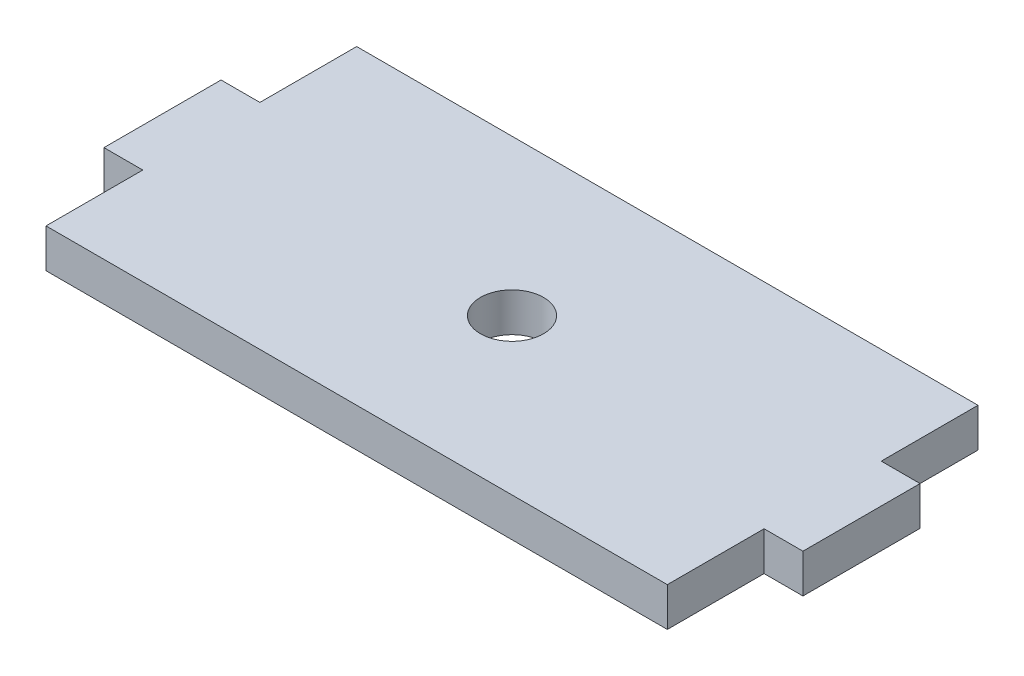
ISO-10303-21;
HEADER;
FILE_DESCRIPTION(('STEP AP214'),'2;1');
FILE_NAME('part.step','',(''),(''),'','','');
FILE_SCHEMA(('AUTOMOTIVE_DESIGN { 1 0 10303 214 1 1 1 1 }'));
ENDSEC;
DATA;
#1=APPLICATION_CONTEXT('core data for automotive mechanical design processes');
#2=APPLICATION_PROTOCOL_DEFINITION('international standard','automotive_design',2000,#1);
#3=PRODUCT_CONTEXT('',#1,'mechanical');
#4=PRODUCT('Part','Part','',(#3));
#5=PRODUCT_RELATED_PRODUCT_CATEGORY('part','',(#4));
#6=PRODUCT_DEFINITION_FORMATION('','',#4);
#7=PRODUCT_DEFINITION_CONTEXT('part definition',#1,'design');
#8=PRODUCT_DEFINITION('design','',#6,#7);
#9=PRODUCT_DEFINITION_SHAPE('','',#8);
#10=(LENGTH_UNIT() NAMED_UNIT(*) SI_UNIT(.MILLI.,.METRE.));
#11=(NAMED_UNIT(*) PLANE_ANGLE_UNIT() SI_UNIT($,.RADIAN.));
#12=(NAMED_UNIT(*) SI_UNIT($,.STERADIAN.) SOLID_ANGLE_UNIT());
#13=UNCERTAINTY_MEASURE_WITH_UNIT(LENGTH_MEASURE(1.E-05),#10,'distance_accuracy_value','');
#14=(GEOMETRIC_REPRESENTATION_CONTEXT(3) GLOBAL_UNCERTAINTY_ASSIGNED_CONTEXT((#13)) GLOBAL_UNIT_ASSIGNED_CONTEXT((#10,
#11,#12)) REPRESENTATION_CONTEXT('',''));
#15=CARTESIAN_POINT('',(0.,0.,0.));
#16=DIRECTION('',(0.,0.,1.));
#17=DIRECTION('',(1.,0.,0.));
#18=AXIS2_PLACEMENT_3D('',#15,#16,#17);
#19=CARTESIAN_POINT('',(25.4,1.5875,0.));
#20=DIRECTION('',(1.,0.,0.));
#21=DIRECTION('',(0.,0.,-1.));
#22=AXIS2_PLACEMENT_3D('',#19,#20,#21);
#23=PLANE('',#22);
#24=DIRECTION('',(0.,0.,1.));
#25=VECTOR('',#24,1.);
#26=CARTESIAN_POINT('',(25.4,-1.5875,0.));
#27=LINE('',#26,#25);
#28=CARTESIAN_POINT('',(25.4,-1.5875,4.7879));
#29=VERTEX_POINT('',#28);
#30=CARTESIAN_POINT('',(25.4,-1.5875,12.7));
#31=VERTEX_POINT('',#30);
#32=EDGE_CURVE('E201',#29,#31,#27,.T.);
#33=ORIENTED_EDGE('',*,*,#32,.F.);
#34=DIRECTION('',(0.,-1.,0.));
#35=VECTOR('',#34,1.);
#36=CARTESIAN_POINT('',(25.4,1.5875,4.7879));
#37=LINE('',#36,#35);
#38=CARTESIAN_POINT('',(25.4,1.5875,4.7879));
#39=VERTEX_POINT('',#38);
#40=EDGE_CURVE('E11',#39,#29,#37,.T.);
#41=ORIENTED_EDGE('',*,*,#40,.F.);
#42=DIRECTION('',(0.,0.,1.));
#43=VECTOR('',#42,1.);
#44=CARTESIAN_POINT('',(25.4,1.5875,0.));
#45=LINE('',#44,#43);
#46=CARTESIAN_POINT('',(25.4,1.5875,12.7));
#47=VERTEX_POINT('',#46);
#48=EDGE_CURVE('E298',#39,#47,#45,.T.);
#49=ORIENTED_EDGE('',*,*,#48,.T.);
#50=DIRECTION('',(0.,-1.,0.));
#51=VECTOR('',#50,1.);
#52=CARTESIAN_POINT('',(25.4,1.5875,12.7));
#53=LINE('',#52,#51);
#54=EDGE_CURVE('E103',#47,#31,#53,.T.);
#55=ORIENTED_EDGE('',*,*,#54,.T.);
#56=EDGE_LOOP('',(#33,#41,#49,#55));
#57=FACE_BOUND('',#56,.T.);
#58=ADVANCED_FACE('F39',(#57),#23,.T.);
#59=CARTESIAN_POINT('',(0.,1.5875,4.7879));
#60=DIRECTION('',(0.,0.,-1.));
#61=DIRECTION('',(-1.,0.,0.));
#62=AXIS2_PLACEMENT_3D('',#59,#60,#61);
#63=PLANE('',#62);
#64=DIRECTION('',(1.,0.,0.));
#65=VECTOR('',#64,1.);
#66=CARTESIAN_POINT('',(0.,-1.5875,4.7879));
#67=LINE('',#66,#65);
#68=CARTESIAN_POINT('',(28.575,-1.5875,4.7879));
#69=VERTEX_POINT('',#68);
#70=EDGE_CURVE('E198',#29,#69,#67,.T.);
#71=ORIENTED_EDGE('',*,*,#70,.T.);
#72=DIRECTION('',(0.,-1.,0.));
#73=VECTOR('',#72,1.);
#74=CARTESIAN_POINT('',(28.575,1.5875,4.7879));
#75=LINE('',#74,#73);
#76=CARTESIAN_POINT('',(28.575,1.5875,4.7879));
#77=VERTEX_POINT('',#76);
#78=EDGE_CURVE('E49',#77,#69,#75,.T.);
#79=ORIENTED_EDGE('',*,*,#78,.F.);
#80=DIRECTION('',(1.,0.,0.));
#81=VECTOR('',#80,1.);
#82=CARTESIAN_POINT('',(0.,1.5875,4.7879));
#83=LINE('',#82,#81);
#84=EDGE_CURVE('E301',#39,#77,#83,.T.);
#85=ORIENTED_EDGE('',*,*,#84,.F.);
#86=ORIENTED_EDGE('',*,*,#40,.T.);
#87=EDGE_LOOP('',(#71,#79,#85,#86));
#88=FACE_BOUND('',#87,.T.);
#89=ADVANCED_FACE('F199',(#88),#63,.F.);
#90=CARTESIAN_POINT('',(28.575,1.5875,0.));
#91=DIRECTION('',(1.,0.,0.));
#92=DIRECTION('',(0.,0.,-1.));
#93=AXIS2_PLACEMENT_3D('',#90,#91,#92);
#94=PLANE('',#93);
#95=DIRECTION('',(0.,0.,1.));
#96=VECTOR('',#95,1.);
#97=CARTESIAN_POINT('',(28.575,-1.5875,0.));
#98=LINE('',#97,#96);
#99=CARTESIAN_POINT('',(28.575,-1.5875,-4.7879));
#100=VERTEX_POINT('',#99);
#101=EDGE_CURVE('E192',#100,#69,#98,.T.);
#102=ORIENTED_EDGE('',*,*,#101,.F.);
#103=DIRECTION('',(0.,-1.,0.));
#104=VECTOR('',#103,1.);
#105=CARTESIAN_POINT('',(28.575,1.5875,-4.7879));
#106=LINE('',#105,#104);
#107=CARTESIAN_POINT('',(28.575,1.5875,-4.7879));
#108=VERTEX_POINT('',#107);
#109=EDGE_CURVE('E182',#108,#100,#106,.T.);
#110=ORIENTED_EDGE('',*,*,#109,.F.);
#111=DIRECTION('',(0.,0.,1.));
#112=VECTOR('',#111,1.);
#113=CARTESIAN_POINT('',(28.575,1.5875,0.));
#114=LINE('',#113,#112);
#115=EDGE_CURVE('E195',#108,#77,#114,.T.);
#116=ORIENTED_EDGE('',*,*,#115,.T.);
#117=ORIENTED_EDGE('',*,*,#78,.T.);
#118=EDGE_LOOP('',(#102,#110,#116,#117));
#119=FACE_BOUND('',#118,.T.);
#120=ADVANCED_FACE('F190',(#119),#94,.T.);
#121=CARTESIAN_POINT('',(0.,1.5875,-4.7879));
#122=DIRECTION('',(0.,0.,-1.));
#123=DIRECTION('',(-1.,0.,0.));
#124=AXIS2_PLACEMENT_3D('',#121,#122,#123);
#125=PLANE('',#124);
#126=DIRECTION('',(1.,0.,0.));
#127=VECTOR('',#126,1.);
#128=CARTESIAN_POINT('',(0.,-1.5875,-4.7879));
#129=LINE('',#128,#127);
#130=CARTESIAN_POINT('',(25.4,-1.5875,-4.7879));
#131=VERTEX_POINT('',#130);
#132=EDGE_CURVE('E206',#131,#100,#129,.T.);
#133=ORIENTED_EDGE('',*,*,#132,.F.);
#134=DIRECTION('',(0.,-1.,0.));
#135=VECTOR('',#134,1.);
#136=CARTESIAN_POINT('',(25.4,1.5875,-4.7879));
#137=LINE('',#136,#135);
#138=CARTESIAN_POINT('',(25.4,1.5875,-4.7879));
#139=VERTEX_POINT('',#138);
#140=EDGE_CURVE('E179',#139,#131,#137,.T.);
#141=ORIENTED_EDGE('',*,*,#140,.F.);
#142=DIRECTION('',(1.,0.,0.));
#143=VECTOR('',#142,1.);
#144=CARTESIAN_POINT('',(0.,1.5875,-4.7879));
#145=LINE('',#144,#143);
#146=EDGE_CURVE('E308',#139,#108,#145,.T.);
#147=ORIENTED_EDGE('',*,*,#146,.T.);
#148=ORIENTED_EDGE('',*,*,#109,.T.);
#149=EDGE_LOOP('',(#133,#141,#147,#148));
#150=FACE_BOUND('',#149,.T.);
#151=ADVANCED_FACE('F255',(#150),#125,.T.);
#152=CARTESIAN_POINT('',(25.4,1.5875,0.));
#153=DIRECTION('',(1.,0.,0.));
#154=DIRECTION('',(0.,0.,-1.));
#155=AXIS2_PLACEMENT_3D('',#152,#153,#154);
#156=PLANE('',#155);
#157=DIRECTION('',(0.,0.,1.));
#158=VECTOR('',#157,1.);
#159=CARTESIAN_POINT('',(25.4,-1.5875,0.));
#160=LINE('',#159,#158);
#161=CARTESIAN_POINT('',(25.3999999999999,-1.5875,-12.7));
#162=VERTEX_POINT('',#161);
#163=EDGE_CURVE('E210',#162,#131,#160,.T.);
#164=ORIENTED_EDGE('',*,*,#163,.F.);
#165=DIRECTION('',(0.,-1.,0.));
#166=VECTOR('',#165,1.);
#167=CARTESIAN_POINT('',(25.3999999999999,1.5875,-12.7));
#168=LINE('',#167,#166);
#169=CARTESIAN_POINT('',(25.3999999999999,1.5875,-12.7));
#170=VERTEX_POINT('',#169);
#171=EDGE_CURVE('E176',#170,#162,#168,.T.);
#172=ORIENTED_EDGE('',*,*,#171,.F.);
#173=DIRECTION('',(0.,0.,1.));
#174=VECTOR('',#173,1.);
#175=CARTESIAN_POINT('',(25.4,1.5875,0.));
#176=LINE('',#175,#174);
#177=EDGE_CURVE('E312',#170,#139,#176,.T.);
#178=ORIENTED_EDGE('',*,*,#177,.T.);
#179=ORIENTED_EDGE('',*,*,#140,.T.);
#180=EDGE_LOOP('',(#164,#172,#178,#179));
#181=FACE_BOUND('',#180,.T.);
#182=ADVANCED_FACE('F258',(#181),#156,.T.);
#183=CARTESIAN_POINT('',(0.,1.5875,-12.7));
#184=DIRECTION('',(0.,0.,-1.));
#185=DIRECTION('',(-1.,0.,0.));
#186=AXIS2_PLACEMENT_3D('',#183,#184,#185);
#187=PLANE('',#186);
#188=DIRECTION('',(1.,0.,0.));
#189=VECTOR('',#188,1.);
#190=CARTESIAN_POINT('',(0.,-1.5875,-12.7));
#191=LINE('',#190,#189);
#192=CARTESIAN_POINT('',(-25.4000000000001,-1.5875,-12.7));
#193=VERTEX_POINT('',#192);
#194=EDGE_CURVE('E216',#193,#162,#191,.T.);
#195=ORIENTED_EDGE('',*,*,#194,.F.);
#196=DIRECTION('',(0.,-1.,0.));
#197=VECTOR('',#196,1.);
#198=CARTESIAN_POINT('',(-25.4000000000001,1.5875,-12.7));
#199=LINE('',#198,#197);
#200=CARTESIAN_POINT('',(-25.4000000000001,1.5875,-12.7));
#201=VERTEX_POINT('',#200);
#202=EDGE_CURVE('E173',#201,#193,#199,.T.);
#203=ORIENTED_EDGE('',*,*,#202,.F.);
#204=DIRECTION('',(1.,0.,0.));
#205=VECTOR('',#204,1.);
#206=CARTESIAN_POINT('',(0.,1.5875,-12.7));
#207=LINE('',#206,#205);
#208=EDGE_CURVE('E316',#201,#170,#207,.T.);
#209=ORIENTED_EDGE('',*,*,#208,.T.);
#210=ORIENTED_EDGE('',*,*,#171,.T.);
#211=EDGE_LOOP('',(#195,#203,#209,#210));
#212=FACE_BOUND('',#211,.T.);
#213=ADVANCED_FACE('F262',(#212),#187,.T.);
#214=CARTESIAN_POINT('',(-25.4,1.5875,0.));
#215=DIRECTION('',(1.,0.,0.));
#216=DIRECTION('',(0.,0.,-1.));
#217=AXIS2_PLACEMENT_3D('',#214,#215,#216);
#218=PLANE('',#217);
#219=DIRECTION('',(0.,0.,1.));
#220=VECTOR('',#219,1.);
#221=CARTESIAN_POINT('',(-25.4,-1.5875,0.));
#222=LINE('',#221,#220);
#223=CARTESIAN_POINT('',(-25.4,-1.5875,-4.7879));
#224=VERTEX_POINT('',#223);
#225=EDGE_CURVE('E220',#193,#224,#222,.T.);
#226=ORIENTED_EDGE('',*,*,#225,.T.);
#227=DIRECTION('',(0.,-1.,0.));
#228=VECTOR('',#227,1.);
#229=CARTESIAN_POINT('',(-25.4,1.5875,-4.7879));
#230=LINE('',#229,#228);
#231=CARTESIAN_POINT('',(-25.4,1.5875,-4.7879));
#232=VERTEX_POINT('',#231);
#233=EDGE_CURVE('E170',#232,#224,#230,.T.);
#234=ORIENTED_EDGE('',*,*,#233,.F.);
#235=DIRECTION('',(0.,0.,1.));
#236=VECTOR('',#235,1.);
#237=CARTESIAN_POINT('',(-25.4,1.5875,0.));
#238=LINE('',#237,#236);
#239=EDGE_CURVE('E320',#201,#232,#238,.T.);
#240=ORIENTED_EDGE('',*,*,#239,.F.);
#241=ORIENTED_EDGE('',*,*,#202,.T.);
#242=EDGE_LOOP('',(#226,#234,#240,#241));
#243=FACE_BOUND('',#242,.T.);
#244=ADVANCED_FACE('F266',(#243),#218,.F.);
#245=CARTESIAN_POINT('',(0.,1.5875,-4.78790000000001));
#246=DIRECTION('',(0.,0.,-1.));
#247=DIRECTION('',(-1.,0.,0.));
#248=AXIS2_PLACEMENT_3D('',#245,#246,#247);
#249=PLANE('',#248);
#250=DIRECTION('',(1.,0.,0.));
#251=VECTOR('',#250,1.);
#252=CARTESIAN_POINT('',(0.,-1.5875,-4.78790000000001));
#253=LINE('',#252,#251);
#254=CARTESIAN_POINT('',(-28.575,-1.5875,-4.7879));
#255=VERTEX_POINT('',#254);
#256=EDGE_CURVE('E224',#255,#224,#253,.T.);
#257=ORIENTED_EDGE('',*,*,#256,.F.);
#258=DIRECTION('',(0.,-1.,0.));
#259=VECTOR('',#258,1.);
#260=CARTESIAN_POINT('',(-28.575,1.5875,-4.7879));
#261=LINE('',#260,#259);
#262=CARTESIAN_POINT('',(-28.575,1.5875,-4.7879));
#263=VERTEX_POINT('',#262);
#264=EDGE_CURVE('E163',#263,#255,#261,.T.);
#265=ORIENTED_EDGE('',*,*,#264,.F.);
#266=DIRECTION('',(1.,0.,0.));
#267=VECTOR('',#266,1.);
#268=CARTESIAN_POINT('',(0.,1.5875,-4.78790000000001));
#269=LINE('',#268,#267);
#270=EDGE_CURVE('E323',#263,#232,#269,.T.);
#271=ORIENTED_EDGE('',*,*,#270,.T.);
#272=ORIENTED_EDGE('',*,*,#233,.T.);
#273=EDGE_LOOP('',(#257,#265,#271,#272));
#274=FACE_BOUND('',#273,.T.);
#275=ADVANCED_FACE('F270',(#274),#249,.T.);
#276=CARTESIAN_POINT('',(-28.575,1.5875,0.));
#277=DIRECTION('',(1.,0.,0.));
#278=DIRECTION('',(0.,0.,-1.));
#279=AXIS2_PLACEMENT_3D('',#276,#277,#278);
#280=PLANE('',#279);
#281=DIRECTION('',(0.,0.,1.));
#282=VECTOR('',#281,1.);
#283=CARTESIAN_POINT('',(-28.575,-1.5875,0.));
#284=LINE('',#283,#282);
#285=CARTESIAN_POINT('',(-28.575,-1.5875,4.7879));
#286=VERTEX_POINT('',#285);
#287=EDGE_CURVE('E228',#255,#286,#284,.T.);
#288=ORIENTED_EDGE('',*,*,#287,.T.);
#289=DIRECTION('',(0.,-1.,0.));
#290=VECTOR('',#289,1.);
#291=CARTESIAN_POINT('',(-28.575,1.5875,4.7879));
#292=LINE('',#291,#290);
#293=CARTESIAN_POINT('',(-28.575,1.5875,4.7879));
#294=VERTEX_POINT('',#293);
#295=EDGE_CURVE('E159',#294,#286,#292,.T.);
#296=ORIENTED_EDGE('',*,*,#295,.F.);
#297=DIRECTION('',(0.,0.,1.));
#298=VECTOR('',#297,1.);
#299=CARTESIAN_POINT('',(-28.575,1.5875,0.));
#300=LINE('',#299,#298);
#301=EDGE_CURVE('E150',#263,#294,#300,.T.);
#302=ORIENTED_EDGE('',*,*,#301,.F.);
#303=ORIENTED_EDGE('',*,*,#264,.T.);
#304=EDGE_LOOP('',(#288,#296,#302,#303));
#305=FACE_BOUND('',#304,.T.);
#306=ADVANCED_FACE('F274',(#305),#280,.F.);
#307=CARTESIAN_POINT('',(0.,1.5875,4.7879));
#308=DIRECTION('',(0.,0.,-1.));
#309=DIRECTION('',(-1.,0.,0.));
#310=AXIS2_PLACEMENT_3D('',#307,#308,#309);
#311=PLANE('',#310);
#312=DIRECTION('',(1.,0.,0.));
#313=VECTOR('',#312,1.);
#314=CARTESIAN_POINT('',(0.,-1.5875,4.7879));
#315=LINE('',#314,#313);
#316=CARTESIAN_POINT('',(-25.4,-1.5875,4.7879));
#317=VERTEX_POINT('',#316);
#318=EDGE_CURVE('E157',#286,#317,#315,.T.);
#319=ORIENTED_EDGE('',*,*,#318,.T.);
#320=DIRECTION('',(0.,-1.,0.));
#321=VECTOR('',#320,1.);
#322=CARTESIAN_POINT('',(-25.4,1.5875,4.7879));
#323=LINE('',#322,#321);
#324=CARTESIAN_POINT('',(-25.4,1.5875,4.7879));
#325=VERTEX_POINT('',#324);
#326=EDGE_CURVE('E140',#325,#317,#323,.T.);
#327=ORIENTED_EDGE('',*,*,#326,.F.);
#328=DIRECTION('',(1.,0.,0.));
#329=VECTOR('',#328,1.);
#330=CARTESIAN_POINT('',(0.,1.5875,4.7879));
#331=LINE('',#330,#329);
#332=EDGE_CURVE('E144',#294,#325,#331,.T.);
#333=ORIENTED_EDGE('',*,*,#332,.F.);
#334=ORIENTED_EDGE('',*,*,#295,.T.);
#335=EDGE_LOOP('',(#319,#327,#333,#334));
#336=FACE_BOUND('',#335,.T.);
#337=ADVANCED_FACE('F156',(#336),#311,.F.);
#338=CARTESIAN_POINT('',(-25.4,1.5875,0.));
#339=DIRECTION('',(1.,0.,0.));
#340=DIRECTION('',(0.,0.,-1.));
#341=AXIS2_PLACEMENT_3D('',#338,#339,#340);
#342=PLANE('',#341);
#343=DIRECTION('',(0.,0.,1.));
#344=VECTOR('',#343,1.);
#345=CARTESIAN_POINT('',(-25.4,-1.5875,0.));
#346=LINE('',#345,#344);
#347=CARTESIAN_POINT('',(-25.4,-1.5875,12.7));
#348=VERTEX_POINT('',#347);
#349=EDGE_CURVE('E234',#317,#348,#346,.T.);
#350=ORIENTED_EDGE('',*,*,#349,.T.);
#351=DIRECTION('',(0.,-1.,0.));
#352=VECTOR('',#351,1.);
#353=CARTESIAN_POINT('',(-25.4,1.5875,12.7));
#354=LINE('',#353,#352);
#355=CARTESIAN_POINT('',(-25.4,1.5875,12.7));
#356=VERTEX_POINT('',#355);
#357=EDGE_CURVE('E142',#356,#348,#354,.T.);
#358=ORIENTED_EDGE('',*,*,#357,.F.);
#359=DIRECTION('',(0.,0.,1.));
#360=VECTOR('',#359,1.);
#361=CARTESIAN_POINT('',(-25.4,1.5875,0.));
#362=LINE('',#361,#360);
#363=EDGE_CURVE('E135',#325,#356,#362,.T.);
#364=ORIENTED_EDGE('',*,*,#363,.F.);
#365=ORIENTED_EDGE('',*,*,#326,.T.);
#366=EDGE_LOOP('',(#350,#358,#364,#365));
#367=FACE_BOUND('',#366,.T.);
#368=ADVANCED_FACE('F138',(#367),#342,.F.);
#369=CARTESIAN_POINT('',(0.,1.5875,0.));
#370=DIRECTION('',(0.,-1.,0.));
#371=DIRECTION('',(0.,0.,-1.));
#372=AXIS2_PLACEMENT_3D('',#369,#370,#371);
#373=CYLINDRICAL_SURFACE('',#372,2.5796875);
#374=CARTESIAN_POINT('',(0.,1.5875,0.));
#375=DIRECTION('',(0.,1.,0.));
#376=DIRECTION('',(0.,0.,1.));
#377=AXIS2_PLACEMENT_3D('',#374,#375,#376);
#378=CIRCLE('',#377,2.5796875);
#379=CARTESIAN_POINT('',(0.,1.5875,2.57968750000002));
#380=VERTEX_POINT('',#379);
#381=EDGE_CURVE('E238',#380,#380,#378,.T.);
#382=ORIENTED_EDGE('',*,*,#381,.T.);
#383=EDGE_LOOP('',(#382));
#384=FACE_BOUND('',#383,.T.);
#385=CARTESIAN_POINT('',(0.,-1.5875,0.));
#386=DIRECTION('',(0.,1.,0.));
#387=DIRECTION('',(0.,0.,1.));
#388=AXIS2_PLACEMENT_3D('',#385,#386,#387);
#389=CIRCLE('',#388,2.5796875);
#390=CARTESIAN_POINT('',(0.,-1.5875,2.57968750000002));
#391=VERTEX_POINT('',#390);
#392=EDGE_CURVE('E243',#391,#391,#389,.T.);
#393=ORIENTED_EDGE('',*,*,#392,.F.);
#394=EDGE_LOOP('',(#393));
#395=FACE_BOUND('',#394,.T.);
#396=ADVANCED_FACE('F41',(#384,#395),#373,.F.);
#397=CARTESIAN_POINT('',(0.,1.5875,12.7));
#398=DIRECTION('',(0.,0.,-1.));
#399=DIRECTION('',(-1.,0.,0.));
#400=AXIS2_PLACEMENT_3D('',#397,#398,#399);
#401=PLANE('',#400);
#402=DIRECTION('',(1.,0.,0.));
#403=VECTOR('',#402,1.);
#404=CARTESIAN_POINT('',(0.,-1.5875,12.7));
#405=LINE('',#404,#403);
#406=EDGE_CURVE('E96',#348,#31,#405,.T.);
#407=ORIENTED_EDGE('',*,*,#406,.T.);
#408=ORIENTED_EDGE('',*,*,#54,.F.);
#409=DIRECTION('',(1.,0.,0.));
#410=VECTOR('',#409,1.);
#411=CARTESIAN_POINT('',(0.,1.5875,12.7));
#412=LINE('',#411,#410);
#413=EDGE_CURVE('E57',#356,#47,#412,.T.);
#414=ORIENTED_EDGE('',*,*,#413,.F.);
#415=ORIENTED_EDGE('',*,*,#357,.T.);
#416=EDGE_LOOP('',(#407,#408,#414,#415));
#417=FACE_BOUND('',#416,.T.);
#418=ADVANCED_FACE('F283',(#417),#401,.F.);
#419=CARTESIAN_POINT('',(0.,1.5875,0.));
#420=DIRECTION('',(0.,1.,0.));
#421=DIRECTION('',(0.,0.,1.));
#422=AXIS2_PLACEMENT_3D('',#419,#420,#421);
#423=PLANE('',#422);
#424=ORIENTED_EDGE('',*,*,#381,.F.);
#425=EDGE_LOOP('',(#424));
#426=FACE_BOUND('',#425,.T.);
#427=ORIENTED_EDGE('',*,*,#48,.F.);
#428=ORIENTED_EDGE('',*,*,#84,.T.);
#429=ORIENTED_EDGE('',*,*,#115,.F.);
#430=ORIENTED_EDGE('',*,*,#146,.F.);
#431=ORIENTED_EDGE('',*,*,#177,.F.);
#432=ORIENTED_EDGE('',*,*,#208,.F.);
#433=ORIENTED_EDGE('',*,*,#239,.T.);
#434=ORIENTED_EDGE('',*,*,#270,.F.);
#435=ORIENTED_EDGE('',*,*,#301,.T.);
#436=ORIENTED_EDGE('',*,*,#332,.T.);
#437=ORIENTED_EDGE('',*,*,#363,.T.);
#438=ORIENTED_EDGE('',*,*,#413,.T.);
#439=EDGE_LOOP('',(#427,#428,#429,#430,#431,#432,#433,#434,#435,#436,#437,#438));
#440=FACE_BOUND('',#439,.T.);
#441=ADVANCED_FACE('F147',(#426,#440),#423,.T.);
#442=CARTESIAN_POINT('',(0.,-1.5875,0.));
#443=DIRECTION('',(0.,1.,0.));
#444=DIRECTION('',(0.,0.,1.));
#445=AXIS2_PLACEMENT_3D('',#442,#443,#444);
#446=PLANE('',#445);
#447=ORIENTED_EDGE('',*,*,#392,.T.);
#448=EDGE_LOOP('',(#447));
#449=FACE_BOUND('',#448,.T.);
#450=ORIENTED_EDGE('',*,*,#32,.T.);
#451=ORIENTED_EDGE('',*,*,#406,.F.);
#452=ORIENTED_EDGE('',*,*,#349,.F.);
#453=ORIENTED_EDGE('',*,*,#318,.F.);
#454=ORIENTED_EDGE('',*,*,#287,.F.);
#455=ORIENTED_EDGE('',*,*,#256,.T.);
#456=ORIENTED_EDGE('',*,*,#225,.F.);
#457=ORIENTED_EDGE('',*,*,#194,.T.);
#458=ORIENTED_EDGE('',*,*,#163,.T.);
#459=ORIENTED_EDGE('',*,*,#132,.T.);
#460=ORIENTED_EDGE('',*,*,#101,.T.);
#461=ORIENTED_EDGE('',*,*,#70,.F.);
#462=EDGE_LOOP('',(#450,#451,#452,#453,#454,#455,#456,#457,#458,#459,#460,#461));
#463=FACE_BOUND('',#462,.T.);
#464=ADVANCED_FACE('F203',(#449,#463),#446,.F.);
#465=CLOSED_SHELL('',(#58,#89,#120,#151,#182,#213,#244,#275,#306,#337,#368,#396,#418,#441,#464));
#466=MANIFOLD_SOLID_BREP('B2',#465);
#467=ADVANCED_BREP_SHAPE_REPRESENTATION('',(#18,#466),#14);
#468=SHAPE_DEFINITION_REPRESENTATION(#9,#467);
ENDSEC;
END-ISO-10303-21;
